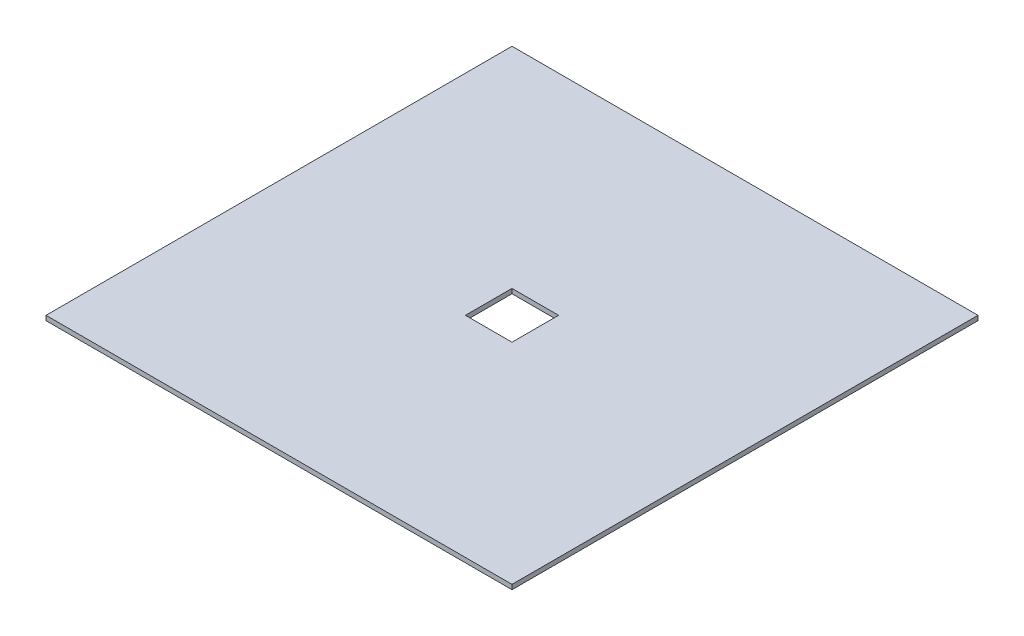
ISO-10303-21;
HEADER;
FILE_DESCRIPTION(('STEP AP214'),'2;1');
FILE_NAME('part.step','',(''),(''),'','','');
FILE_SCHEMA(('AUTOMOTIVE_DESIGN { 1 0 10303 214 1 1 1 1 }'));
ENDSEC;
DATA;
#1=APPLICATION_CONTEXT('core data for automotive mechanical design processes');
#2=APPLICATION_PROTOCOL_DEFINITION('international standard','automotive_design',2000,#1);
#3=PRODUCT_CONTEXT('',#1,'mechanical');
#4=PRODUCT('Part','Part','',(#3));
#5=PRODUCT_RELATED_PRODUCT_CATEGORY('part','',(#4));
#6=PRODUCT_DEFINITION_FORMATION('','',#4);
#7=PRODUCT_DEFINITION_CONTEXT('part definition',#1,'design');
#8=PRODUCT_DEFINITION('design','',#6,#7);
#9=PRODUCT_DEFINITION_SHAPE('','',#8);
#10=(LENGTH_UNIT() NAMED_UNIT(*) SI_UNIT(.MILLI.,.METRE.));
#11=(NAMED_UNIT(*) PLANE_ANGLE_UNIT() SI_UNIT($,.RADIAN.));
#12=(NAMED_UNIT(*) SI_UNIT($,.STERADIAN.) SOLID_ANGLE_UNIT());
#13=UNCERTAINTY_MEASURE_WITH_UNIT(LENGTH_MEASURE(1.E-05),#10,'distance_accuracy_value','');
#14=(GEOMETRIC_REPRESENTATION_CONTEXT(3) GLOBAL_UNCERTAINTY_ASSIGNED_CONTEXT((#13)) GLOBAL_UNIT_ASSIGNED_CONTEXT((#10,
#11,#12)) REPRESENTATION_CONTEXT('',''));
#15=CARTESIAN_POINT('',(0.,0.,0.));
#16=DIRECTION('',(0.,0.,1.));
#17=DIRECTION('',(1.,0.,0.));
#18=AXIS2_PLACEMENT_3D('',#15,#16,#17);
#19=CARTESIAN_POINT('',(0.,5.,0.));
#20=DIRECTION('',(0.,1.,0.));
#21=DIRECTION('',(0.,0.,1.));
#22=AXIS2_PLACEMENT_3D('',#19,#20,#21);
#23=PLANE('',#22);
#24=DIRECTION('',(0.,0.,1.));
#25=VECTOR('',#24,1.);
#26=CARTESIAN_POINT('',(-250.,5.,-250.));
#27=LINE('',#26,#25);
#28=CARTESIAN_POINT('',(-250.,5.,-250.));
#29=VERTEX_POINT('',#28);
#30=CARTESIAN_POINT('',(-250.,5.,250.));
#31=VERTEX_POINT('',#30);
#32=EDGE_CURVE('E124',#29,#31,#27,.T.);
#33=ORIENTED_EDGE('',*,*,#32,.T.);
#34=DIRECTION('',(1.,0.,0.));
#35=VECTOR('',#34,1.);
#36=CARTESIAN_POINT('',(-250.,5.,250.));
#37=LINE('',#36,#35);
#38=CARTESIAN_POINT('',(250.,5.,250.));
#39=VERTEX_POINT('',#38);
#40=EDGE_CURVE('E127',#31,#39,#37,.T.);
#41=ORIENTED_EDGE('',*,*,#40,.T.);
#42=DIRECTION('',(0.,0.,1.));
#43=VECTOR('',#42,1.);
#44=CARTESIAN_POINT('',(250.,5.,-250.));
#45=LINE('',#44,#43);
#46=CARTESIAN_POINT('',(250.,5.,-250.));
#47=VERTEX_POINT('',#46);
#48=EDGE_CURVE('E130',#47,#39,#45,.T.);
#49=ORIENTED_EDGE('',*,*,#48,.F.);
#50=DIRECTION('',(1.,0.,0.));
#51=VECTOR('',#50,1.);
#52=CARTESIAN_POINT('',(-250.,5.,-250.));
#53=LINE('',#52,#51);
#54=EDGE_CURVE('E133',#29,#47,#53,.T.);
#55=ORIENTED_EDGE('',*,*,#54,.F.);
#56=EDGE_LOOP('',(#33,#41,#49,#55));
#57=FACE_BOUND('',#56,.T.);
#58=DIRECTION('',(-1.,0.,0.));
#59=VECTOR('',#58,1.);
#60=CARTESIAN_POINT('',(-25.,5.,-25.));
#61=LINE('',#60,#59);
#62=CARTESIAN_POINT('',(25.,5.,-25.));
#63=VERTEX_POINT('',#62);
#64=CARTESIAN_POINT('',(-25.,5.,-25.));
#65=VERTEX_POINT('',#64);
#66=EDGE_CURVE('E104',#63,#65,#61,.T.);
#67=ORIENTED_EDGE('',*,*,#66,.F.);
#68=DIRECTION('',(0.,0.,-1.));
#69=VECTOR('',#68,1.);
#70=CARTESIAN_POINT('',(25.,5.,25.));
#71=LINE('',#70,#69);
#72=CARTESIAN_POINT('',(25.,5.,25.));
#73=VERTEX_POINT('',#72);
#74=EDGE_CURVE('E96',#73,#63,#71,.T.);
#75=ORIENTED_EDGE('',*,*,#74,.F.);
#76=DIRECTION('',(1.,0.,0.));
#77=VECTOR('',#76,1.);
#78=CARTESIAN_POINT('',(-25.,5.,25.));
#79=LINE('',#78,#77);
#80=CARTESIAN_POINT('',(-25.,5.,25.));
#81=VERTEX_POINT('',#80);
#82=EDGE_CURVE('E117',#81,#73,#79,.T.);
#83=ORIENTED_EDGE('',*,*,#82,.F.);
#84=DIRECTION('',(0.,0.,1.));
#85=VECTOR('',#84,1.);
#86=CARTESIAN_POINT('',(-25.,5.,25.));
#87=LINE('',#86,#85);
#88=EDGE_CURVE('E115',#65,#81,#87,.T.);
#89=ORIENTED_EDGE('',*,*,#88,.F.);
#90=EDGE_LOOP('',(#67,#75,#83,#89));
#91=FACE_BOUND('',#90,.T.);
#92=ADVANCED_FACE('F33',(#57,#91),#23,.T.);
#93=CARTESIAN_POINT('',(0.,0.,0.));
#94=DIRECTION('',(0.,1.,0.));
#95=DIRECTION('',(0.,0.,1.));
#96=AXIS2_PLACEMENT_3D('',#93,#94,#95);
#97=PLANE('',#96);
#98=DIRECTION('',(0.,0.,1.));
#99=VECTOR('',#98,1.);
#100=CARTESIAN_POINT('',(-250.,0.,-250.));
#101=LINE('',#100,#99);
#102=CARTESIAN_POINT('',(-250.,0.,-250.));
#103=VERTEX_POINT('',#102);
#104=CARTESIAN_POINT('',(-250.,0.,250.));
#105=VERTEX_POINT('',#104);
#106=EDGE_CURVE('E111',#103,#105,#101,.T.);
#107=ORIENTED_EDGE('',*,*,#106,.F.);
#108=DIRECTION('',(1.,0.,0.));
#109=VECTOR('',#108,1.);
#110=CARTESIAN_POINT('',(-250.,0.,-250.));
#111=LINE('',#110,#109);
#112=CARTESIAN_POINT('',(250.,0.,-250.));
#113=VERTEX_POINT('',#112);
#114=EDGE_CURVE('E128',#103,#113,#111,.T.);
#115=ORIENTED_EDGE('',*,*,#114,.T.);
#116=DIRECTION('',(0.,0.,1.));
#117=VECTOR('',#116,1.);
#118=CARTESIAN_POINT('',(250.,0.,-250.));
#119=LINE('',#118,#117);
#120=CARTESIAN_POINT('',(250.,0.,250.));
#121=VERTEX_POINT('',#120);
#122=EDGE_CURVE('E142',#113,#121,#119,.T.);
#123=ORIENTED_EDGE('',*,*,#122,.T.);
#124=DIRECTION('',(1.,0.,0.));
#125=VECTOR('',#124,1.);
#126=CARTESIAN_POINT('',(-250.,0.,250.));
#127=LINE('',#126,#125);
#128=EDGE_CURVE('E139',#105,#121,#127,.T.);
#129=ORIENTED_EDGE('',*,*,#128,.F.);
#130=EDGE_LOOP('',(#107,#115,#123,#129));
#131=FACE_BOUND('',#130,.T.);
#132=DIRECTION('',(0.,0.,1.));
#133=VECTOR('',#132,1.);
#134=CARTESIAN_POINT('',(25.,0.,0.));
#135=LINE('',#134,#133);
#136=CARTESIAN_POINT('',(25.,0.,-25.));
#137=VERTEX_POINT('',#136);
#138=CARTESIAN_POINT('',(25.,0.,25.));
#139=VERTEX_POINT('',#138);
#140=EDGE_CURVE('E11',#137,#139,#135,.T.);
#141=ORIENTED_EDGE('',*,*,#140,.F.);
#142=DIRECTION('',(1.,0.,0.));
#143=VECTOR('',#142,1.);
#144=CARTESIAN_POINT('',(0.,0.,-25.));
#145=LINE('',#144,#143);
#146=CARTESIAN_POINT('',(-25.,0.,-25.));
#147=VERTEX_POINT('',#146);
#148=EDGE_CURVE('E41',#147,#137,#145,.T.);
#149=ORIENTED_EDGE('',*,*,#148,.F.);
#150=DIRECTION('',(0.,0.,-1.));
#151=VECTOR('',#150,1.);
#152=CARTESIAN_POINT('',(-25.,0.,0.));
#153=LINE('',#152,#151);
#154=CARTESIAN_POINT('',(-25.,0.,25.));
#155=VERTEX_POINT('',#154);
#156=EDGE_CURVE('E157',#155,#147,#153,.T.);
#157=ORIENTED_EDGE('',*,*,#156,.F.);
#158=DIRECTION('',(-1.,0.,0.));
#159=VECTOR('',#158,1.);
#160=CARTESIAN_POINT('',(0.,0.,25.));
#161=LINE('',#160,#159);
#162=EDGE_CURVE('E155',#139,#155,#161,.T.);
#163=ORIENTED_EDGE('',*,*,#162,.F.);
#164=EDGE_LOOP('',(#141,#149,#157,#163));
#165=FACE_BOUND('',#164,.T.);
#166=ADVANCED_FACE('F163',(#131,#165),#97,.F.);
#167=CARTESIAN_POINT('',(-250.,5.,-250.));
#168=DIRECTION('',(1.,0.,0.));
#169=DIRECTION('',(0.,0.,-1.));
#170=AXIS2_PLACEMENT_3D('',#167,#168,#169);
#171=PLANE('',#170);
#172=ORIENTED_EDGE('',*,*,#106,.T.);
#173=DIRECTION('',(0.,-1.,0.));
#174=VECTOR('',#173,1.);
#175=CARTESIAN_POINT('',(-250.,5.,250.));
#176=LINE('',#175,#174);
#177=EDGE_CURVE('E152',#31,#105,#176,.T.);
#178=ORIENTED_EDGE('',*,*,#177,.F.);
#179=ORIENTED_EDGE('',*,*,#32,.F.);
#180=DIRECTION('',(0.,-1.,0.));
#181=VECTOR('',#180,1.);
#182=CARTESIAN_POINT('',(-250.,5.,-250.));
#183=LINE('',#182,#181);
#184=EDGE_CURVE('E136',#29,#103,#183,.T.);
#185=ORIENTED_EDGE('',*,*,#184,.T.);
#186=EDGE_LOOP('',(#172,#178,#179,#185));
#187=FACE_BOUND('',#186,.T.);
#188=ADVANCED_FACE('F35',(#187),#171,.F.);
#189=CARTESIAN_POINT('',(-250.,5.,250.));
#190=DIRECTION('',(0.,0.,-1.));
#191=DIRECTION('',(-1.,0.,0.));
#192=AXIS2_PLACEMENT_3D('',#189,#190,#191);
#193=PLANE('',#192);
#194=ORIENTED_EDGE('',*,*,#128,.T.);
#195=DIRECTION('',(0.,-1.,0.));
#196=VECTOR('',#195,1.);
#197=CARTESIAN_POINT('',(250.,5.,250.));
#198=LINE('',#197,#196);
#199=EDGE_CURVE('E150',#39,#121,#198,.T.);
#200=ORIENTED_EDGE('',*,*,#199,.F.);
#201=ORIENTED_EDGE('',*,*,#40,.F.);
#202=ORIENTED_EDGE('',*,*,#177,.T.);
#203=EDGE_LOOP('',(#194,#200,#201,#202));
#204=FACE_BOUND('',#203,.T.);
#205=ADVANCED_FACE('F189',(#204),#193,.F.);
#206=CARTESIAN_POINT('',(250.,5.,-250.));
#207=DIRECTION('',(1.,0.,0.));
#208=DIRECTION('',(0.,0.,-1.));
#209=AXIS2_PLACEMENT_3D('',#206,#207,#208);
#210=PLANE('',#209);
#211=ORIENTED_EDGE('',*,*,#122,.F.);
#212=DIRECTION('',(0.,-1.,0.));
#213=VECTOR('',#212,1.);
#214=CARTESIAN_POINT('',(250.,5.,-250.));
#215=LINE('',#214,#213);
#216=EDGE_CURVE('E148',#47,#113,#215,.T.);
#217=ORIENTED_EDGE('',*,*,#216,.F.);
#218=ORIENTED_EDGE('',*,*,#48,.T.);
#219=ORIENTED_EDGE('',*,*,#199,.T.);
#220=EDGE_LOOP('',(#211,#217,#218,#219));
#221=FACE_BOUND('',#220,.T.);
#222=ADVANCED_FACE('F186',(#221),#210,.T.);
#223=CARTESIAN_POINT('',(-250.,5.,-250.));
#224=DIRECTION('',(0.,0.,-1.));
#225=DIRECTION('',(-1.,0.,0.));
#226=AXIS2_PLACEMENT_3D('',#223,#224,#225);
#227=PLANE('',#226);
#228=ORIENTED_EDGE('',*,*,#114,.F.);
#229=ORIENTED_EDGE('',*,*,#184,.F.);
#230=ORIENTED_EDGE('',*,*,#54,.T.);
#231=ORIENTED_EDGE('',*,*,#216,.T.);
#232=EDGE_LOOP('',(#228,#229,#230,#231));
#233=FACE_BOUND('',#232,.T.);
#234=ADVANCED_FACE('F183',(#233),#227,.T.);
#235=CARTESIAN_POINT('',(25.,5.,25.));
#236=DIRECTION('',(-1.,0.,0.));
#237=DIRECTION('',(0.,0.,1.));
#238=AXIS2_PLACEMENT_3D('',#235,#236,#237);
#239=PLANE('',#238);
#240=ORIENTED_EDGE('',*,*,#140,.T.);
#241=DIRECTION('',(0.,-1.,0.));
#242=VECTOR('',#241,1.);
#243=CARTESIAN_POINT('',(25.,5.,25.));
#244=LINE('',#243,#242);
#245=EDGE_CURVE('E53',#73,#139,#244,.T.);
#246=ORIENTED_EDGE('',*,*,#245,.F.);
#247=ORIENTED_EDGE('',*,*,#74,.T.);
#248=DIRECTION('',(0.,-1.,0.));
#249=VECTOR('',#248,1.);
#250=CARTESIAN_POINT('',(25.,5.,-25.));
#251=LINE('',#250,#249);
#252=EDGE_CURVE('E99',#63,#137,#251,.T.);
#253=ORIENTED_EDGE('',*,*,#252,.T.);
#254=EDGE_LOOP('',(#240,#246,#247,#253));
#255=FACE_BOUND('',#254,.T.);
#256=ADVANCED_FACE('F98',(#255),#239,.T.);
#257=CARTESIAN_POINT('',(-25.,5.,-25.));
#258=DIRECTION('',(0.,0.,1.));
#259=DIRECTION('',(1.,0.,0.));
#260=AXIS2_PLACEMENT_3D('',#257,#258,#259);
#261=PLANE('',#260);
#262=ORIENTED_EDGE('',*,*,#148,.T.);
#263=ORIENTED_EDGE('',*,*,#252,.F.);
#264=ORIENTED_EDGE('',*,*,#66,.T.);
#265=DIRECTION('',(0.,-1.,0.));
#266=VECTOR('',#265,1.);
#267=CARTESIAN_POINT('',(-25.,5.,-25.));
#268=LINE('',#267,#266);
#269=EDGE_CURVE('E112',#65,#147,#268,.T.);
#270=ORIENTED_EDGE('',*,*,#269,.T.);
#271=EDGE_LOOP('',(#262,#263,#264,#270));
#272=FACE_BOUND('',#271,.T.);
#273=ADVANCED_FACE('F107',(#272),#261,.T.);
#274=CARTESIAN_POINT('',(-25.,5.,25.));
#275=DIRECTION('',(1.,0.,0.));
#276=DIRECTION('',(0.,0.,-1.));
#277=AXIS2_PLACEMENT_3D('',#274,#275,#276);
#278=PLANE('',#277);
#279=ORIENTED_EDGE('',*,*,#156,.T.);
#280=ORIENTED_EDGE('',*,*,#269,.F.);
#281=ORIENTED_EDGE('',*,*,#88,.T.);
#282=DIRECTION('',(0.,-1.,0.));
#283=VECTOR('',#282,1.);
#284=CARTESIAN_POINT('',(-25.,5.,25.));
#285=LINE('',#284,#283);
#286=EDGE_CURVE('E48',#81,#155,#285,.T.);
#287=ORIENTED_EDGE('',*,*,#286,.T.);
#288=EDGE_LOOP('',(#279,#280,#281,#287));
#289=FACE_BOUND('',#288,.T.);
#290=ADVANCED_FACE('F160',(#289),#278,.T.);
#291=CARTESIAN_POINT('',(-25.,5.,25.));
#292=DIRECTION('',(0.,0.,-1.));
#293=DIRECTION('',(-1.,0.,0.));
#294=AXIS2_PLACEMENT_3D('',#291,#292,#293);
#295=PLANE('',#294);
#296=ORIENTED_EDGE('',*,*,#162,.T.);
#297=ORIENTED_EDGE('',*,*,#286,.F.);
#298=ORIENTED_EDGE('',*,*,#82,.T.);
#299=ORIENTED_EDGE('',*,*,#245,.T.);
#300=EDGE_LOOP('',(#296,#297,#298,#299));
#301=FACE_BOUND('',#300,.T.);
#302=ADVANCED_FACE('F164',(#301),#295,.T.);
#303=CLOSED_SHELL('',(#92,#166,#188,#205,#222,#234,#256,#273,#290,#302));
#304=MANIFOLD_SOLID_BREP('B2',#303);
#305=ADVANCED_BREP_SHAPE_REPRESENTATION('',(#18,#304),#14);
#306=SHAPE_DEFINITION_REPRESENTATION(#9,#305);
ENDSEC;
END-ISO-10303-21;
